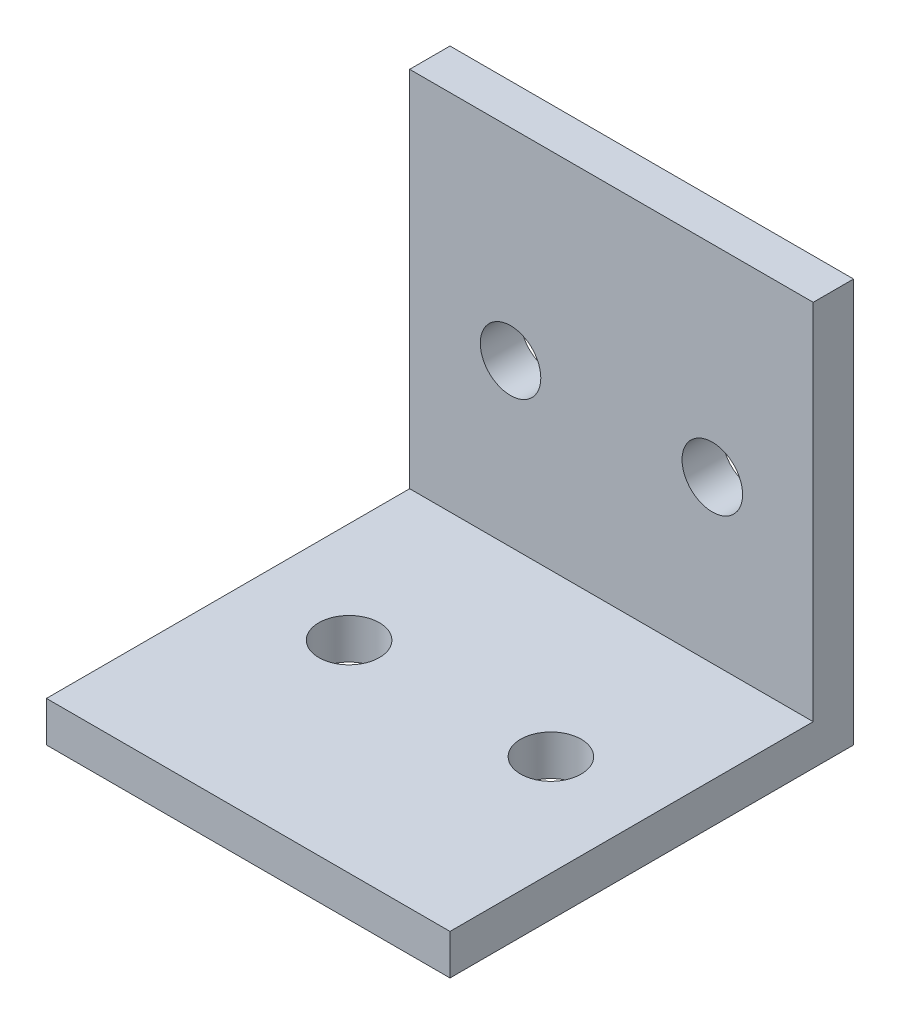
ISO-10303-21;
HEADER;
FILE_DESCRIPTION(('STEP AP214'),'2;1');
FILE_NAME('part.step','',(''),(''),'','','');
FILE_SCHEMA(('AUTOMOTIVE_DESIGN { 1 0 10303 214 1 1 1 1 }'));
ENDSEC;
DATA;
#1=APPLICATION_CONTEXT('core data for automotive mechanical design processes');
#2=APPLICATION_PROTOCOL_DEFINITION('international standard','automotive_design',2000,#1);
#3=PRODUCT_CONTEXT('',#1,'mechanical');
#4=PRODUCT('Part','Part','',(#3));
#5=PRODUCT_RELATED_PRODUCT_CATEGORY('part','',(#4));
#6=PRODUCT_DEFINITION_FORMATION('','',#4);
#7=PRODUCT_DEFINITION_CONTEXT('part definition',#1,'design');
#8=PRODUCT_DEFINITION('design','',#6,#7);
#9=PRODUCT_DEFINITION_SHAPE('','',#8);
#10=(LENGTH_UNIT() NAMED_UNIT(*) SI_UNIT(.MILLI.,.METRE.));
#11=(NAMED_UNIT(*) PLANE_ANGLE_UNIT() SI_UNIT($,.RADIAN.));
#12=(NAMED_UNIT(*) SI_UNIT($,.STERADIAN.) SOLID_ANGLE_UNIT());
#13=UNCERTAINTY_MEASURE_WITH_UNIT(LENGTH_MEASURE(1.E-05),#10,'distance_accuracy_value','');
#14=(GEOMETRIC_REPRESENTATION_CONTEXT(3) GLOBAL_UNCERTAINTY_ASSIGNED_CONTEXT((#13)) GLOBAL_UNIT_ASSIGNED_CONTEXT((#10,
#11,#12)) REPRESENTATION_CONTEXT('',''));
#15=CARTESIAN_POINT('',(0.,0.,0.));
#16=DIRECTION('',(0.,0.,1.));
#17=DIRECTION('',(1.,0.,0.));
#18=AXIS2_PLACEMENT_3D('',#15,#16,#17);
#19=CARTESIAN_POINT('',(10.,10.,2.));
#20=DIRECTION('',(-1.,0.,0.));
#21=DIRECTION('',(0.,-1.,0.));
#22=AXIS2_PLACEMENT_3D('',#19,#20,#21);
#23=PLANE('',#22);
#24=DIRECTION('',(0.,1.,0.));
#25=VECTOR('',#24,1.);
#26=CARTESIAN_POINT('',(10.,10.,0.));
#27=LINE('',#26,#25);
#28=CARTESIAN_POINT('',(10.,-10.,0.));
#29=VERTEX_POINT('',#28);
#30=CARTESIAN_POINT('',(10.,10.,0.));
#31=VERTEX_POINT('',#30);
#32=EDGE_CURVE('E95',#29,#31,#27,.T.);
#33=ORIENTED_EDGE('',*,*,#32,.T.);
#34=DIRECTION('',(0.,0.,-1.));
#35=VECTOR('',#34,1.);
#36=CARTESIAN_POINT('',(10.,10.,2.));
#37=LINE('',#36,#35);
#38=CARTESIAN_POINT('',(10.,10.,2.));
#39=VERTEX_POINT('',#38);
#40=EDGE_CURVE('E11',#39,#31,#37,.T.);
#41=ORIENTED_EDGE('',*,*,#40,.F.);
#42=DIRECTION('',(0.,1.,0.));
#43=VECTOR('',#42,1.);
#44=CARTESIAN_POINT('',(10.,10.,2.));
#45=LINE('',#44,#43);
#46=CARTESIAN_POINT('',(10.,-8.,2.));
#47=VERTEX_POINT('',#46);
#48=EDGE_CURVE('E88',#47,#39,#45,.T.);
#49=ORIENTED_EDGE('',*,*,#48,.F.);
#50=DIRECTION('',(0.,0.,-1.));
#51=VECTOR('',#50,1.);
#52=CARTESIAN_POINT('',(10.,-8.,20.));
#53=LINE('',#52,#51);
#54=CARTESIAN_POINT('',(10.,-8.,20.));
#55=VERTEX_POINT('',#54);
#56=EDGE_CURVE('E103',#55,#47,#53,.T.);
#57=ORIENTED_EDGE('',*,*,#56,.F.);
#58=DIRECTION('',(0.,1.,0.));
#59=VECTOR('',#58,1.);
#60=CARTESIAN_POINT('',(10.,-10.,20.));
#61=LINE('',#60,#59);
#62=CARTESIAN_POINT('',(10.,-10.,20.));
#63=VERTEX_POINT('',#62);
#64=EDGE_CURVE('E98',#63,#55,#61,.T.);
#65=ORIENTED_EDGE('',*,*,#64,.F.);
#66=DIRECTION('',(0.,0.,-1.));
#67=VECTOR('',#66,1.);
#68=CARTESIAN_POINT('',(10.,-10.,2.));
#69=LINE('',#68,#67);
#70=EDGE_CURVE('E81',#63,#29,#69,.T.);
#71=ORIENTED_EDGE('',*,*,#70,.T.);
#72=EDGE_LOOP('',(#33,#41,#49,#57,#65,#71));
#73=FACE_BOUND('',#72,.T.);
#74=ADVANCED_FACE('F34',(#73),#23,.F.);
#75=CARTESIAN_POINT('',(-10.,10.,2.));
#76=DIRECTION('',(0.,-1.,0.));
#77=DIRECTION('',(0.,0.,-1.));
#78=AXIS2_PLACEMENT_3D('',#75,#76,#77);
#79=PLANE('',#78);
#80=DIRECTION('',(-1.,0.,0.));
#81=VECTOR('',#80,1.);
#82=CARTESIAN_POINT('',(-10.,10.,0.));
#83=LINE('',#82,#81);
#84=CARTESIAN_POINT('',(-10.,10.,0.));
#85=VERTEX_POINT('',#84);
#86=EDGE_CURVE('E102',#31,#85,#83,.T.);
#87=ORIENTED_EDGE('',*,*,#86,.T.);
#88=DIRECTION('',(0.,0.,-1.));
#89=VECTOR('',#88,1.);
#90=CARTESIAN_POINT('',(-10.,10.,2.));
#91=LINE('',#90,#89);
#92=CARTESIAN_POINT('',(-10.,10.,2.));
#93=VERTEX_POINT('',#92);
#94=EDGE_CURVE('E42',#93,#85,#91,.T.);
#95=ORIENTED_EDGE('',*,*,#94,.F.);
#96=DIRECTION('',(-1.,0.,0.));
#97=VECTOR('',#96,1.);
#98=CARTESIAN_POINT('',(-10.,10.,2.));
#99=LINE('',#98,#97);
#100=EDGE_CURVE('E56',#39,#93,#99,.T.);
#101=ORIENTED_EDGE('',*,*,#100,.F.);
#102=ORIENTED_EDGE('',*,*,#40,.T.);
#103=EDGE_LOOP('',(#87,#95,#101,#102));
#104=FACE_BOUND('',#103,.T.);
#105=ADVANCED_FACE('F160',(#104),#79,.F.);
#106=CARTESIAN_POINT('',(-10.,10.,2.));
#107=DIRECTION('',(1.,0.,0.));
#108=DIRECTION('',(0.,0.,-1.));
#109=AXIS2_PLACEMENT_3D('',#106,#107,#108);
#110=PLANE('',#109);
#111=DIRECTION('',(0.,-1.,0.));
#112=VECTOR('',#111,1.);
#113=CARTESIAN_POINT('',(-10.,10.,0.));
#114=LINE('',#113,#112);
#115=CARTESIAN_POINT('',(-10.,-10.,0.));
#116=VERTEX_POINT('',#115);
#117=EDGE_CURVE('E89',#85,#116,#114,.T.);
#118=ORIENTED_EDGE('',*,*,#117,.T.);
#119=DIRECTION('',(0.,0.,-1.));
#120=VECTOR('',#119,1.);
#121=CARTESIAN_POINT('',(-10.,-10.,2.));
#122=LINE('',#121,#120);
#123=CARTESIAN_POINT('',(-10.,-10.,20.));
#124=VERTEX_POINT('',#123);
#125=EDGE_CURVE('E84',#124,#116,#122,.T.);
#126=ORIENTED_EDGE('',*,*,#125,.F.);
#127=DIRECTION('',(0.,-1.,0.));
#128=VECTOR('',#127,1.);
#129=CARTESIAN_POINT('',(-10.,-10.,20.));
#130=LINE('',#129,#128);
#131=CARTESIAN_POINT('',(-10.,-8.,20.));
#132=VERTEX_POINT('',#131);
#133=EDGE_CURVE('E120',#132,#124,#130,.T.);
#134=ORIENTED_EDGE('',*,*,#133,.F.);
#135=DIRECTION('',(0.,0.,-1.));
#136=VECTOR('',#135,1.);
#137=CARTESIAN_POINT('',(-10.,-8.,20.));
#138=LINE('',#137,#136);
#139=CARTESIAN_POINT('',(-10.,-8.,2.));
#140=VERTEX_POINT('',#139);
#141=EDGE_CURVE('E107',#132,#140,#138,.T.);
#142=ORIENTED_EDGE('',*,*,#141,.T.);
#143=DIRECTION('',(0.,-1.,0.));
#144=VECTOR('',#143,1.);
#145=CARTESIAN_POINT('',(-10.,10.,2.));
#146=LINE('',#145,#144);
#147=EDGE_CURVE('E99',#93,#140,#146,.T.);
#148=ORIENTED_EDGE('',*,*,#147,.F.);
#149=ORIENTED_EDGE('',*,*,#94,.T.);
#150=EDGE_LOOP('',(#118,#126,#134,#142,#148,#149));
#151=FACE_BOUND('',#150,.T.);
#152=ADVANCED_FACE('F151',(#151),#110,.F.);
#153=CARTESIAN_POINT('',(-10.,-10.,2.));
#154=DIRECTION('',(0.,1.,0.));
#155=DIRECTION('',(0.,0.,1.));
#156=AXIS2_PLACEMENT_3D('',#153,#154,#155);
#157=PLANE('',#156);
#158=CARTESIAN_POINT('',(5.,-10.,10.));
#159=DIRECTION('',(0.,-1.,0.));
#160=DIRECTION('',(0.,0.,-1.));
#161=AXIS2_PLACEMENT_3D('',#158,#159,#160);
#162=CIRCLE('',#161,1.5);
#163=CARTESIAN_POINT('',(5.,-10.,8.5));
#164=VERTEX_POINT('',#163);
#165=EDGE_CURVE('E127',#164,#164,#162,.T.);
#166=ORIENTED_EDGE('',*,*,#165,.F.);
#167=EDGE_LOOP('',(#166));
#168=FACE_BOUND('',#167,.T.);
#169=CARTESIAN_POINT('',(-5.,-10.,10.));
#170=DIRECTION('',(0.,-1.,0.));
#171=DIRECTION('',(0.,0.,-1.));
#172=AXIS2_PLACEMENT_3D('',#169,#170,#171);
#173=CIRCLE('',#172,1.5);
#174=CARTESIAN_POINT('',(-5.,-10.,8.5));
#175=VERTEX_POINT('',#174);
#176=EDGE_CURVE('E117',#175,#175,#173,.T.);
#177=ORIENTED_EDGE('',*,*,#176,.F.);
#178=EDGE_LOOP('',(#177));
#179=FACE_BOUND('',#178,.T.);
#180=DIRECTION('',(1.,0.,0.));
#181=VECTOR('',#180,1.);
#182=CARTESIAN_POINT('',(-10.,-10.,0.));
#183=LINE('',#182,#181);
#184=EDGE_CURVE('E76',#116,#29,#183,.T.);
#185=ORIENTED_EDGE('',*,*,#184,.T.);
#186=ORIENTED_EDGE('',*,*,#70,.F.);
#187=DIRECTION('',(1.,0.,0.));
#188=VECTOR('',#187,1.);
#189=CARTESIAN_POINT('',(-10.,-10.,20.));
#190=LINE('',#189,#188);
#191=EDGE_CURVE('E133',#124,#63,#190,.T.);
#192=ORIENTED_EDGE('',*,*,#191,.F.);
#193=ORIENTED_EDGE('',*,*,#125,.T.);
#194=EDGE_LOOP('',(#185,#186,#192,#193));
#195=FACE_BOUND('',#194,.T.);
#196=ADVANCED_FACE('F78',(#168,#179,#195),#157,.F.);
#197=CARTESIAN_POINT('',(0.,0.,2.));
#198=DIRECTION('',(0.,0.,1.));
#199=DIRECTION('',(1.,0.,0.));
#200=AXIS2_PLACEMENT_3D('',#197,#198,#199);
#201=PLANE('',#200);
#202=CARTESIAN_POINT('',(5.,0.,2.));
#203=DIRECTION('',(0.,0.,1.));
#204=DIRECTION('',(1.,0.,0.));
#205=AXIS2_PLACEMENT_3D('',#202,#203,#204);
#206=CIRCLE('',#205,1.5);
#207=CARTESIAN_POINT('',(6.5,0.,2.));
#208=VERTEX_POINT('',#207);
#209=EDGE_CURVE('E201',#208,#208,#206,.T.);
#210=ORIENTED_EDGE('',*,*,#209,.F.);
#211=EDGE_LOOP('',(#210));
#212=FACE_BOUND('',#211,.T.);
#213=CARTESIAN_POINT('',(-5.,0.,2.));
#214=DIRECTION('',(0.,0.,1.));
#215=DIRECTION('',(1.,0.,0.));
#216=AXIS2_PLACEMENT_3D('',#213,#214,#215);
#217=CIRCLE('',#216,1.5);
#218=CARTESIAN_POINT('',(-3.5,0.,2.));
#219=VERTEX_POINT('',#218);
#220=EDGE_CURVE('E210',#219,#219,#217,.T.);
#221=ORIENTED_EDGE('',*,*,#220,.F.);
#222=EDGE_LOOP('',(#221));
#223=FACE_BOUND('',#222,.T.);
#224=DIRECTION('',(-1.,0.,0.));
#225=VECTOR('',#224,1.);
#226=CARTESIAN_POINT('',(-10.,-8.,2.));
#227=LINE('',#226,#225);
#228=EDGE_CURVE('E50',#47,#140,#227,.T.);
#229=ORIENTED_EDGE('',*,*,#228,.F.);
#230=ORIENTED_EDGE('',*,*,#48,.T.);
#231=ORIENTED_EDGE('',*,*,#100,.T.);
#232=ORIENTED_EDGE('',*,*,#147,.T.);
#233=EDGE_LOOP('',(#229,#230,#231,#232));
#234=FACE_BOUND('',#233,.T.);
#235=ADVANCED_FACE('F143',(#212,#223,#234),#201,.T.);
#236=CARTESIAN_POINT('',(0.,0.,0.));
#237=DIRECTION('',(0.,0.,1.));
#238=DIRECTION('',(1.,0.,0.));
#239=AXIS2_PLACEMENT_3D('',#236,#237,#238);
#240=PLANE('',#239);
#241=CARTESIAN_POINT('',(5.,0.,0.));
#242=DIRECTION('',(0.,0.,-1.));
#243=DIRECTION('',(-1.,0.,0.));
#244=AXIS2_PLACEMENT_3D('',#241,#242,#243);
#245=CIRCLE('',#244,1.5);
#246=CARTESIAN_POINT('',(3.5,0.,0.));
#247=VERTEX_POINT('',#246);
#248=EDGE_CURVE('E204',#247,#247,#245,.T.);
#249=ORIENTED_EDGE('',*,*,#248,.F.);
#250=EDGE_LOOP('',(#249));
#251=FACE_BOUND('',#250,.T.);
#252=CARTESIAN_POINT('',(-5.,0.,0.));
#253=DIRECTION('',(0.,0.,-1.));
#254=DIRECTION('',(-1.,0.,0.));
#255=AXIS2_PLACEMENT_3D('',#252,#253,#254);
#256=CIRCLE('',#255,1.5);
#257=CARTESIAN_POINT('',(-6.5,0.,0.));
#258=VERTEX_POINT('',#257);
#259=EDGE_CURVE('E206',#258,#258,#256,.T.);
#260=ORIENTED_EDGE('',*,*,#259,.F.);
#261=EDGE_LOOP('',(#260));
#262=FACE_BOUND('',#261,.T.);
#263=ORIENTED_EDGE('',*,*,#32,.F.);
#264=ORIENTED_EDGE('',*,*,#184,.F.);
#265=ORIENTED_EDGE('',*,*,#117,.F.);
#266=ORIENTED_EDGE('',*,*,#86,.F.);
#267=EDGE_LOOP('',(#263,#264,#265,#266));
#268=FACE_BOUND('',#267,.T.);
#269=ADVANCED_FACE('F101',(#251,#262,#268),#240,.F.);
#270=CARTESIAN_POINT('',(-10.,-8.,20.));
#271=DIRECTION('',(0.,-1.,0.));
#272=DIRECTION('',(0.,0.,-1.));
#273=AXIS2_PLACEMENT_3D('',#270,#271,#272);
#274=PLANE('',#273);
#275=CARTESIAN_POINT('',(5.,-8.,10.));
#276=DIRECTION('',(0.,-1.,0.));
#277=DIRECTION('',(0.,0.,-1.));
#278=AXIS2_PLACEMENT_3D('',#275,#276,#277);
#279=CIRCLE('',#278,1.5);
#280=CARTESIAN_POINT('',(5.,-8.,8.5));
#281=VERTEX_POINT('',#280);
#282=EDGE_CURVE('E37',#281,#281,#279,.T.);
#283=ORIENTED_EDGE('',*,*,#282,.T.);
#284=EDGE_LOOP('',(#283));
#285=FACE_BOUND('',#284,.T.);
#286=CARTESIAN_POINT('',(-5.,-8.,10.));
#287=DIRECTION('',(0.,-1.,0.));
#288=DIRECTION('',(0.,0.,-1.));
#289=AXIS2_PLACEMENT_3D('',#286,#287,#288);
#290=CIRCLE('',#289,1.5);
#291=CARTESIAN_POINT('',(-5.,-8.,8.5));
#292=VERTEX_POINT('',#291);
#293=EDGE_CURVE('E115',#292,#292,#290,.T.);
#294=ORIENTED_EDGE('',*,*,#293,.T.);
#295=EDGE_LOOP('',(#294));
#296=FACE_BOUND('',#295,.T.);
#297=ORIENTED_EDGE('',*,*,#228,.T.);
#298=ORIENTED_EDGE('',*,*,#141,.F.);
#299=DIRECTION('',(-1.,0.,0.));
#300=VECTOR('',#299,1.);
#301=CARTESIAN_POINT('',(-10.,-8.,20.));
#302=LINE('',#301,#300);
#303=EDGE_CURVE('E136',#55,#132,#302,.T.);
#304=ORIENTED_EDGE('',*,*,#303,.F.);
#305=ORIENTED_EDGE('',*,*,#56,.T.);
#306=EDGE_LOOP('',(#297,#298,#304,#305));
#307=FACE_BOUND('',#306,.T.);
#308=ADVANCED_FACE('F148',(#285,#296,#307),#274,.F.);
#309=CARTESIAN_POINT('',(0.,0.,20.));
#310=DIRECTION('',(0.,0.,-1.));
#311=DIRECTION('',(-1.,0.,0.));
#312=AXIS2_PLACEMENT_3D('',#309,#310,#311);
#313=PLANE('',#312);
#314=ORIENTED_EDGE('',*,*,#133,.T.);
#315=ORIENTED_EDGE('',*,*,#191,.T.);
#316=ORIENTED_EDGE('',*,*,#64,.T.);
#317=ORIENTED_EDGE('',*,*,#303,.T.);
#318=EDGE_LOOP('',(#314,#315,#316,#317));
#319=FACE_BOUND('',#318,.T.);
#320=ADVANCED_FACE('F155',(#319),#313,.F.);
#321=CARTESIAN_POINT('',(-5.,8.,10.));
#322=DIRECTION('',(0.,-1.,0.));
#323=DIRECTION('',(0.,0.,-1.));
#324=AXIS2_PLACEMENT_3D('',#321,#322,#323);
#325=CYLINDRICAL_SURFACE('',#324,1.5);
#326=ORIENTED_EDGE('',*,*,#176,.T.);
#327=EDGE_LOOP('',(#326));
#328=FACE_BOUND('',#327,.T.);
#329=ORIENTED_EDGE('',*,*,#293,.F.);
#330=EDGE_LOOP('',(#329));
#331=FACE_BOUND('',#330,.T.);
#332=ADVANCED_FACE('F182',(#328,#331),#325,.F.);
#333=CARTESIAN_POINT('',(5.,8.,10.));
#334=DIRECTION('',(0.,-1.,0.));
#335=DIRECTION('',(0.,0.,-1.));
#336=AXIS2_PLACEMENT_3D('',#333,#334,#335);
#337=CYLINDRICAL_SURFACE('',#336,1.5);
#338=ORIENTED_EDGE('',*,*,#165,.T.);
#339=EDGE_LOOP('',(#338));
#340=FACE_BOUND('',#339,.T.);
#341=ORIENTED_EDGE('',*,*,#282,.F.);
#342=EDGE_LOOP('',(#341));
#343=FACE_BOUND('',#342,.T.);
#344=ADVANCED_FACE('F185',(#340,#343),#337,.F.);
#345=CARTESIAN_POINT('',(-5.,0.,18.));
#346=DIRECTION('',(0.,0.,-1.));
#347=DIRECTION('',(-1.,0.,0.));
#348=AXIS2_PLACEMENT_3D('',#345,#346,#347);
#349=CYLINDRICAL_SURFACE('',#348,1.5);
#350=ORIENTED_EDGE('',*,*,#220,.T.);
#351=EDGE_LOOP('',(#350));
#352=FACE_BOUND('',#351,.T.);
#353=ORIENTED_EDGE('',*,*,#259,.T.);
#354=EDGE_LOOP('',(#353));
#355=FACE_BOUND('',#354,.T.);
#356=ADVANCED_FACE('F188',(#352,#355),#349,.F.);
#357=CARTESIAN_POINT('',(5.,0.,18.));
#358=DIRECTION('',(0.,0.,-1.));
#359=DIRECTION('',(-1.,0.,0.));
#360=AXIS2_PLACEMENT_3D('',#357,#358,#359);
#361=CYLINDRICAL_SURFACE('',#360,1.5);
#362=ORIENTED_EDGE('',*,*,#209,.T.);
#363=EDGE_LOOP('',(#362));
#364=FACE_BOUND('',#363,.T.);
#365=ORIENTED_EDGE('',*,*,#248,.T.);
#366=EDGE_LOOP('',(#365));
#367=FACE_BOUND('',#366,.T.);
#368=ADVANCED_FACE('F192',(#364,#367),#361,.F.);
#369=CLOSED_SHELL('',(#74,#105,#152,#196,#235,#269,#308,#320,#332,#344,#356,#368));
#370=MANIFOLD_SOLID_BREP('B2',#369);
#371=ADVANCED_BREP_SHAPE_REPRESENTATION('',(#18,#370),#14);
#372=SHAPE_DEFINITION_REPRESENTATION(#9,#371);
ENDSEC;
END-ISO-10303-21;
